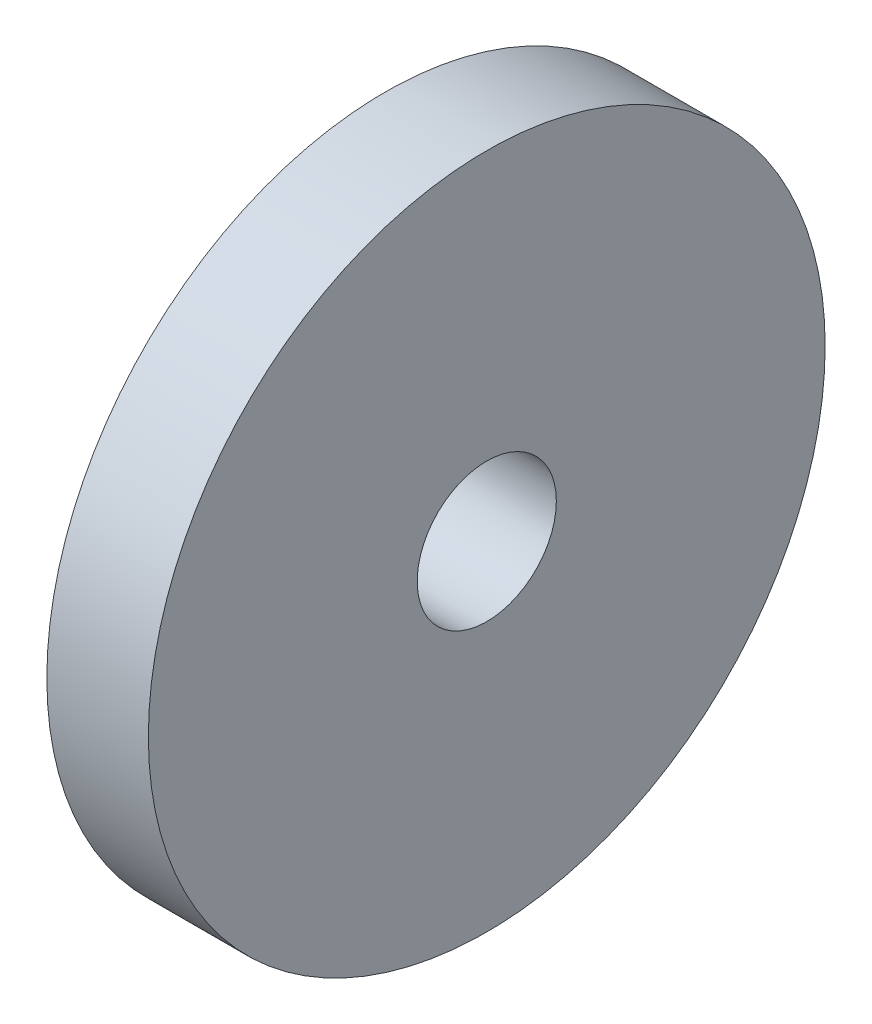
ISO-10303-21;
HEADER;
FILE_DESCRIPTION(('STEP AP214'),'2;1');
FILE_NAME('part.step','',(''),(''),'','','');
FILE_SCHEMA(('AUTOMOTIVE_DESIGN { 1 0 10303 214 1 1 1 1 }'));
ENDSEC;
DATA;
#1=APPLICATION_CONTEXT('core data for automotive mechanical design processes');
#2=APPLICATION_PROTOCOL_DEFINITION('international standard','automotive_design',2000,#1);
#3=PRODUCT_CONTEXT('',#1,'mechanical');
#4=PRODUCT('Part','Part','',(#3));
#5=PRODUCT_RELATED_PRODUCT_CATEGORY('part','',(#4));
#6=PRODUCT_DEFINITION_FORMATION('','',#4);
#7=PRODUCT_DEFINITION_CONTEXT('part definition',#1,'design');
#8=PRODUCT_DEFINITION('design','',#6,#7);
#9=PRODUCT_DEFINITION_SHAPE('','',#8);
#10=(LENGTH_UNIT() NAMED_UNIT(*) SI_UNIT(.MILLI.,.METRE.));
#11=(NAMED_UNIT(*) PLANE_ANGLE_UNIT() SI_UNIT($,.RADIAN.));
#12=(NAMED_UNIT(*) SI_UNIT($,.STERADIAN.) SOLID_ANGLE_UNIT());
#13=UNCERTAINTY_MEASURE_WITH_UNIT(LENGTH_MEASURE(1.E-05),#10,'distance_accuracy_value','');
#14=(GEOMETRIC_REPRESENTATION_CONTEXT(3) GLOBAL_UNCERTAINTY_ASSIGNED_CONTEXT((#13)) GLOBAL_UNIT_ASSIGNED_CONTEXT((#10,
#11,#12)) REPRESENTATION_CONTEXT('',''));
#15=CARTESIAN_POINT('',(0.,0.,0.));
#16=DIRECTION('',(0.,0.,1.));
#17=DIRECTION('',(1.,0.,0.));
#18=AXIS2_PLACEMENT_3D('',#15,#16,#17);
#19=CARTESIAN_POINT('',(91.1225,0.,0.));
#20=DIRECTION('',(-1.,0.,0.));
#21=DIRECTION('',(0.,0.,1.));
#22=AXIS2_PLACEMENT_3D('',#19,#20,#21);
#23=CYLINDRICAL_SURFACE('',#22,3.2639);
#24=CARTESIAN_POINT('',(91.1225,0.,0.));
#25=DIRECTION('',(1.,0.,0.));
#26=DIRECTION('',(0.,0.,-1.));
#27=AXIS2_PLACEMENT_3D('',#24,#25,#26);
#28=CIRCLE('',#27,3.2639);
#29=CARTESIAN_POINT('',(91.1225,0.,-3.2639));
#30=VERTEX_POINT('',#29);
#31=EDGE_CURVE('E10',#30,#30,#28,.T.);
#32=ORIENTED_EDGE('',*,*,#31,.T.);
#33=EDGE_LOOP('',(#32));
#34=FACE_BOUND('',#33,.T.);
#35=CARTESIAN_POINT('',(86.36,0.,0.));
#36=DIRECTION('',(1.,0.,0.));
#37=DIRECTION('',(0.,0.,-1.));
#38=AXIS2_PLACEMENT_3D('',#35,#36,#37);
#39=CIRCLE('',#38,3.2639);
#40=CARTESIAN_POINT('',(86.36,0.,-3.2639));
#41=VERTEX_POINT('',#40);
#42=EDGE_CURVE('E22',#41,#41,#39,.T.);
#43=ORIENTED_EDGE('',*,*,#42,.F.);
#44=EDGE_LOOP('',(#43));
#45=FACE_BOUND('',#44,.T.);
#46=ADVANCED_FACE('F15',(#34,#45),#23,.F.);
#47=CARTESIAN_POINT('',(91.1225,0.,0.));
#48=DIRECTION('',(-1.,0.,0.));
#49=DIRECTION('',(0.,0.,1.));
#50=AXIS2_PLACEMENT_3D('',#47,#48,#49);
#51=CYLINDRICAL_SURFACE('',#50,15.875);
#52=CARTESIAN_POINT('',(91.1225,0.,0.));
#53=DIRECTION('',(1.,0.,0.));
#54=DIRECTION('',(0.,0.,-1.));
#55=AXIS2_PLACEMENT_3D('',#52,#53,#54);
#56=CIRCLE('',#55,15.875);
#57=CARTESIAN_POINT('',(91.1225,0.,-15.875));
#58=VERTEX_POINT('',#57);
#59=EDGE_CURVE('E28',#58,#58,#56,.T.);
#60=ORIENTED_EDGE('',*,*,#59,.F.);
#61=EDGE_LOOP('',(#60));
#62=FACE_BOUND('',#61,.T.);
#63=CARTESIAN_POINT('',(86.36,0.,0.));
#64=DIRECTION('',(1.,0.,0.));
#65=DIRECTION('',(0.,0.,-1.));
#66=AXIS2_PLACEMENT_3D('',#63,#64,#65);
#67=CIRCLE('',#66,15.875);
#68=CARTESIAN_POINT('',(86.36,0.,-15.875));
#69=VERTEX_POINT('',#68);
#70=EDGE_CURVE('E33',#69,#69,#67,.T.);
#71=ORIENTED_EDGE('',*,*,#70,.T.);
#72=EDGE_LOOP('',(#71));
#73=FACE_BOUND('',#72,.T.);
#74=ADVANCED_FACE('F40',(#62,#73),#51,.T.);
#75=CARTESIAN_POINT('',(91.1225,0.,0.));
#76=DIRECTION('',(1.,0.,0.));
#77=DIRECTION('',(0.,1.,0.));
#78=AXIS2_PLACEMENT_3D('',#75,#76,#77);
#79=PLANE('',#78);
#80=ORIENTED_EDGE('',*,*,#31,.F.);
#81=EDGE_LOOP('',(#80));
#82=FACE_BOUND('',#81,.T.);
#83=ORIENTED_EDGE('',*,*,#59,.T.);
#84=EDGE_LOOP('',(#83));
#85=FACE_BOUND('',#84,.T.);
#86=ADVANCED_FACE('F44',(#82,#85),#79,.T.);
#87=CARTESIAN_POINT('',(86.36,0.,0.));
#88=DIRECTION('',(1.,0.,0.));
#89=DIRECTION('',(0.,1.,0.));
#90=AXIS2_PLACEMENT_3D('',#87,#88,#89);
#91=PLANE('',#90);
#92=ORIENTED_EDGE('',*,*,#42,.T.);
#93=EDGE_LOOP('',(#92));
#94=FACE_BOUND('',#93,.T.);
#95=ORIENTED_EDGE('',*,*,#70,.F.);
#96=EDGE_LOOP('',(#95));
#97=FACE_BOUND('',#96,.T.);
#98=ADVANCED_FACE('F42',(#94,#97),#91,.F.);
#99=CLOSED_SHELL('',(#46,#74,#86,#98));
#100=MANIFOLD_SOLID_BREP('B1',#99);
#101=ADVANCED_BREP_SHAPE_REPRESENTATION('',(#18,#100),#14);
#102=SHAPE_DEFINITION_REPRESENTATION(#9,#101);
ENDSEC;
END-ISO-10303-21;
